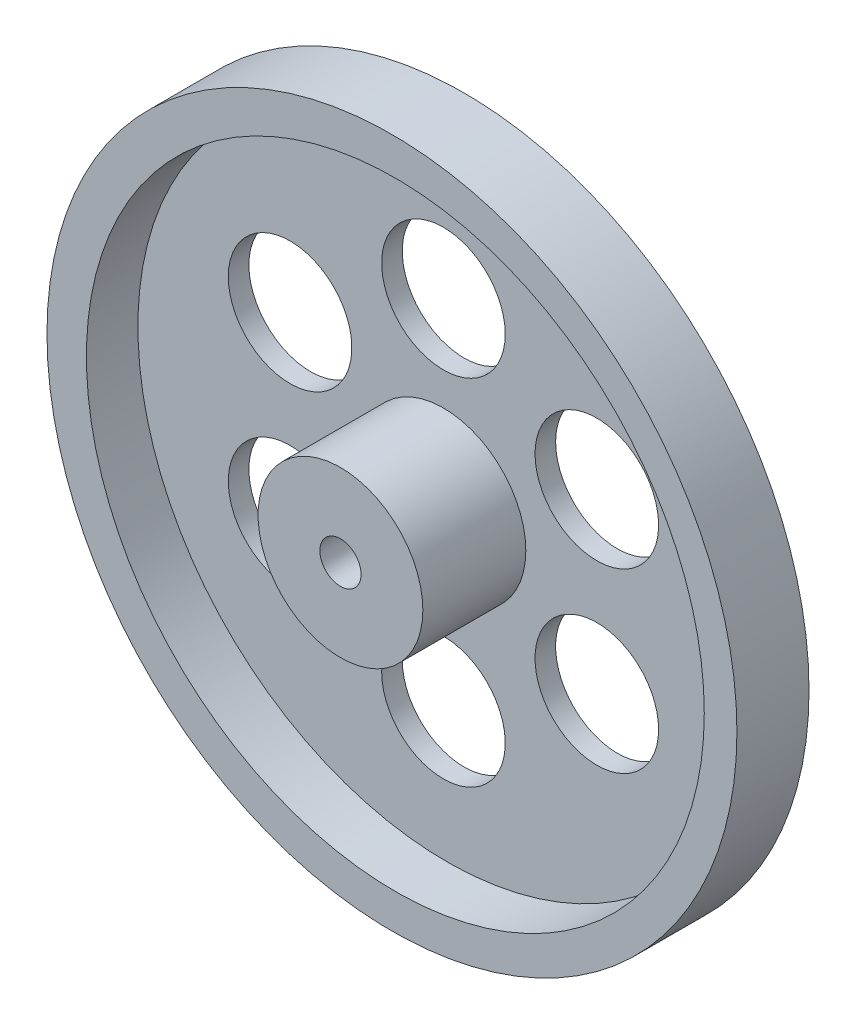
ISO-10303-21;
HEADER;
FILE_DESCRIPTION(('STEP AP214'),'2;1');
FILE_NAME('part.step','',(''),(''),'','','');
FILE_SCHEMA(('AUTOMOTIVE_DESIGN { 1 0 10303 214 1 1 1 1 }'));
ENDSEC;
DATA;
#1=APPLICATION_CONTEXT('core data for automotive mechanical design processes');
#2=APPLICATION_PROTOCOL_DEFINITION('international standard','automotive_design',2000,#1);
#3=PRODUCT_CONTEXT('',#1,'mechanical');
#4=PRODUCT('Part','Part','',(#3));
#5=PRODUCT_RELATED_PRODUCT_CATEGORY('part','',(#4));
#6=PRODUCT_DEFINITION_FORMATION('','',#4);
#7=PRODUCT_DEFINITION_CONTEXT('part definition',#1,'design');
#8=PRODUCT_DEFINITION('design','',#6,#7);
#9=PRODUCT_DEFINITION_SHAPE('','',#8);
#10=(LENGTH_UNIT() NAMED_UNIT(*) SI_UNIT(.MILLI.,.METRE.));
#11=(NAMED_UNIT(*) PLANE_ANGLE_UNIT() SI_UNIT($,.RADIAN.));
#12=(NAMED_UNIT(*) SI_UNIT($,.STERADIAN.) SOLID_ANGLE_UNIT());
#13=UNCERTAINTY_MEASURE_WITH_UNIT(LENGTH_MEASURE(1.E-05),#10,'distance_accuracy_value','');
#14=(GEOMETRIC_REPRESENTATION_CONTEXT(3) GLOBAL_UNCERTAINTY_ASSIGNED_CONTEXT((#13)) GLOBAL_UNIT_ASSIGNED_CONTEXT((#10,
#11,#12)) REPRESENTATION_CONTEXT('',''));
#15=CARTESIAN_POINT('',(0.,0.,0.));
#16=DIRECTION('',(0.,0.,1.));
#17=DIRECTION('',(1.,0.,0.));
#18=AXIS2_PLACEMENT_3D('',#15,#16,#17);
#19=CARTESIAN_POINT('',(0.,0.,7.));
#20=DIRECTION('',(0.,0.,-1.));
#21=DIRECTION('',(-1.,0.,0.));
#22=AXIS2_PLACEMENT_3D('',#19,#20,#21);
#23=CYLINDRICAL_SURFACE('',#22,33.5);
#24=CARTESIAN_POINT('',(0.,0.,7.));
#25=DIRECTION('',(0.,0.,1.));
#26=DIRECTION('',(1.,0.,0.));
#27=AXIS2_PLACEMENT_3D('',#24,#25,#26);
#28=CIRCLE('',#27,33.5);
#29=CARTESIAN_POINT('',(33.5,0.,7.));
#30=VERTEX_POINT('',#29);
#31=EDGE_CURVE('E10',#30,#30,#28,.T.);
#32=ORIENTED_EDGE('',*,*,#31,.F.);
#33=EDGE_LOOP('',(#32));
#34=FACE_BOUND('',#33,.T.);
#35=CARTESIAN_POINT('',(0.,0.,0.));
#36=DIRECTION('',(0.,0.,1.));
#37=DIRECTION('',(1.,0.,0.));
#38=AXIS2_PLACEMENT_3D('',#35,#36,#37);
#39=CIRCLE('',#38,33.5);
#40=CARTESIAN_POINT('',(33.5,0.,0.));
#41=VERTEX_POINT('',#40);
#42=EDGE_CURVE('E38',#41,#41,#39,.T.);
#43=ORIENTED_EDGE('',*,*,#42,.T.);
#44=EDGE_LOOP('',(#43));
#45=FACE_BOUND('',#44,.T.);
#46=ADVANCED_FACE('F35',(#34,#45),#23,.T.);
#47=CARTESIAN_POINT('',(0.,0.,7.));
#48=DIRECTION('',(0.,0.,1.));
#49=DIRECTION('',(1.,0.,0.));
#50=AXIS2_PLACEMENT_3D('',#47,#48,#49);
#51=PLANE('',#50);
#52=CARTESIAN_POINT('',(0.329125808049266,0.,7.));
#53=DIRECTION('',(0.,0.,1.));
#54=DIRECTION('',(1.,0.,0.));
#55=AXIS2_PLACEMENT_3D('',#52,#53,#54);
#56=CIRCLE('',#55,30.);
#57=CARTESIAN_POINT('',(30.3291258080493,0.,7.));
#58=VERTEX_POINT('',#57);
#59=EDGE_CURVE('E47',#58,#58,#56,.T.);
#60=ORIENTED_EDGE('',*,*,#59,.F.);
#61=EDGE_LOOP('',(#60));
#62=FACE_BOUND('',#61,.T.);
#63=ORIENTED_EDGE('',*,*,#31,.T.);
#64=EDGE_LOOP('',(#63));
#65=FACE_BOUND('',#64,.T.);
#66=ADVANCED_FACE('F132',(#62,#65),#51,.T.);
#67=CARTESIAN_POINT('',(0.,0.,0.));
#68=DIRECTION('',(0.,0.,1.));
#69=DIRECTION('',(1.,0.,0.));
#70=AXIS2_PLACEMENT_3D('',#67,#68,#69);
#71=PLANE('',#70);
#72=CARTESIAN_POINT('',(14.8928859899135,8.59841173528723,0.));
#73=DIRECTION('',(0.,0.,1.));
#74=DIRECTION('',(0.50000000000001,-0.866025403784433,0.));
#75=AXIS2_PLACEMENT_3D('',#72,#73,#74);
#76=CIRCLE('',#75,6.);
#77=CARTESIAN_POINT('',(17.8928859899136,3.40225931258063,0.));
#78=VERTEX_POINT('',#77);
#79=EDGE_CURVE('E80',#78,#78,#76,.T.);
#80=ORIENTED_EDGE('',*,*,#79,.T.);
#81=EDGE_LOOP('',(#80));
#82=FACE_BOUND('',#81,.T.);
#83=CARTESIAN_POINT('',(14.8928859899137,-8.59841173528691,0.));
#84=DIRECTION('',(0.,0.,1.));
#85=DIRECTION('',(-0.499999999999992,-0.866025403784443,0.));
#86=AXIS2_PLACEMENT_3D('',#83,#84,#85);
#87=CIRCLE('',#86,6.);
#88=CARTESIAN_POINT('',(11.8928859899138,-13.7945641579936,0.));
#89=VERTEX_POINT('',#88);
#90=EDGE_CURVE('E86',#89,#89,#87,.T.);
#91=ORIENTED_EDGE('',*,*,#90,.T.);
#92=EDGE_LOOP('',(#91));
#93=FACE_BOUND('',#92,.T.);
#94=CARTESIAN_POINT('',(0.,-17.1968234705741,0.));
#95=DIRECTION('',(0.,0.,1.));
#96=DIRECTION('',(-1.,0.,0.));
#97=AXIS2_PLACEMENT_3D('',#94,#95,#96);
#98=CIRCLE('',#97,6.);
#99=CARTESIAN_POINT('',(-6.,-17.1968234705741,0.));
#100=VERTEX_POINT('',#99);
#101=EDGE_CURVE('E92',#100,#100,#98,.T.);
#102=ORIENTED_EDGE('',*,*,#101,.T.);
#103=EDGE_LOOP('',(#102));
#104=FACE_BOUND('',#103,.T.);
#105=CARTESIAN_POINT('',(-14.8928859899136,-8.59841173528712,0.));
#106=DIRECTION('',(0.,0.,1.));
#107=DIRECTION('',(-0.500000000000004,0.866025403784436,0.));
#108=AXIS2_PLACEMENT_3D('',#105,#106,#107);
#109=CIRCLE('',#108,6.);
#110=CARTESIAN_POINT('',(-17.8928859899136,-3.4022593125805,0.));
#111=VERTEX_POINT('',#110);
#112=EDGE_CURVE('E74',#111,#111,#109,.T.);
#113=ORIENTED_EDGE('',*,*,#112,.T.);
#114=EDGE_LOOP('',(#113));
#115=FACE_BOUND('',#114,.T.);
#116=CARTESIAN_POINT('',(-14.8928859899137,8.59841173528702,0.));
#117=DIRECTION('',(0.,0.,1.));
#118=DIRECTION('',(0.499999999999998,0.86602540378444,0.));
#119=AXIS2_PLACEMENT_3D('',#116,#117,#118);
#120=CIRCLE('',#119,6.);
#121=CARTESIAN_POINT('',(-11.8928859899137,13.7945641579937,0.));
#122=VERTEX_POINT('',#121);
#123=EDGE_CURVE('E68',#122,#122,#120,.T.);
#124=ORIENTED_EDGE('',*,*,#123,.T.);
#125=EDGE_LOOP('',(#124));
#126=FACE_BOUND('',#125,.T.);
#127=CARTESIAN_POINT('',(0.,17.1968234705741,0.));
#128=DIRECTION('',(0.,0.,1.));
#129=DIRECTION('',(1.,0.,0.));
#130=AXIS2_PLACEMENT_3D('',#127,#128,#129);
#131=CIRCLE('',#130,6.);
#132=CARTESIAN_POINT('',(6.,17.1968234705741,0.));
#133=VERTEX_POINT('',#132);
#134=EDGE_CURVE('E64',#133,#133,#131,.T.);
#135=ORIENTED_EDGE('',*,*,#134,.T.);
#136=EDGE_LOOP('',(#135));
#137=FACE_BOUND('',#136,.T.);
#138=CARTESIAN_POINT('',(0.,0.,0.));
#139=DIRECTION('',(0.,0.,1.));
#140=DIRECTION('',(1.,0.,0.));
#141=AXIS2_PLACEMENT_3D('',#138,#139,#140);
#142=CIRCLE('',#141,2.);
#143=CARTESIAN_POINT('',(2.,0.,0.));
#144=VERTEX_POINT('',#143);
#145=EDGE_CURVE('E56',#144,#144,#142,.T.);
#146=ORIENTED_EDGE('',*,*,#145,.T.);
#147=EDGE_LOOP('',(#146));
#148=FACE_BOUND('',#147,.T.);
#149=ORIENTED_EDGE('',*,*,#42,.F.);
#150=EDGE_LOOP('',(#149));
#151=FACE_BOUND('',#150,.T.);
#152=ADVANCED_FACE('F101',(#82,#93,#104,#115,#126,#137,#148,#151),#71,.F.);
#153=CARTESIAN_POINT('',(0.329125808049266,0.,2.));
#154=DIRECTION('',(0.,0.,1.));
#155=DIRECTION('',(1.,0.,0.));
#156=AXIS2_PLACEMENT_3D('',#153,#154,#155);
#157=CYLINDRICAL_SURFACE('',#156,30.);
#158=CARTESIAN_POINT('',(0.329125808049266,0.,2.));
#159=DIRECTION('',(0.,0.,1.));
#160=DIRECTION('',(1.,0.,0.));
#161=AXIS2_PLACEMENT_3D('',#158,#159,#160);
#162=CIRCLE('',#161,30.);
#163=CARTESIAN_POINT('',(30.3291258080493,0.,2.));
#164=VERTEX_POINT('',#163);
#165=EDGE_CURVE('E45',#164,#164,#162,.T.);
#166=ORIENTED_EDGE('',*,*,#165,.F.);
#167=EDGE_LOOP('',(#166));
#168=FACE_BOUND('',#167,.T.);
#169=ORIENTED_EDGE('',*,*,#59,.T.);
#170=EDGE_LOOP('',(#169));
#171=FACE_BOUND('',#170,.T.);
#172=ADVANCED_FACE('F116',(#168,#171),#157,.F.);
#173=CARTESIAN_POINT('',(0.329125808049266,0.,2.));
#174=DIRECTION('',(0.,0.,1.));
#175=DIRECTION('',(1.,0.,0.));
#176=AXIS2_PLACEMENT_3D('',#173,#174,#175);
#177=PLANE('',#176);
#178=CARTESIAN_POINT('',(14.8928859899135,8.59841173528723,2.));
#179=DIRECTION('',(0.,0.,1.));
#180=DIRECTION('',(0.50000000000001,-0.866025403784433,0.));
#181=AXIS2_PLACEMENT_3D('',#178,#179,#180);
#182=CIRCLE('',#181,6.);
#183=CARTESIAN_POINT('',(17.8928859899136,3.40225931258063,2.));
#184=VERTEX_POINT('',#183);
#185=EDGE_CURVE('E77',#184,#184,#182,.T.);
#186=ORIENTED_EDGE('',*,*,#185,.F.);
#187=EDGE_LOOP('',(#186));
#188=FACE_BOUND('',#187,.T.);
#189=CARTESIAN_POINT('',(14.8928859899137,-8.59841173528691,2.));
#190=DIRECTION('',(0.,0.,1.));
#191=DIRECTION('',(-0.499999999999992,-0.866025403784443,0.));
#192=AXIS2_PLACEMENT_3D('',#189,#190,#191);
#193=CIRCLE('',#192,6.);
#194=CARTESIAN_POINT('',(11.8928859899138,-13.7945641579936,2.));
#195=VERTEX_POINT('',#194);
#196=EDGE_CURVE('E83',#195,#195,#193,.T.);
#197=ORIENTED_EDGE('',*,*,#196,.F.);
#198=EDGE_LOOP('',(#197));
#199=FACE_BOUND('',#198,.T.);
#200=CARTESIAN_POINT('',(0.,-17.1968234705741,2.));
#201=DIRECTION('',(0.,0.,1.));
#202=DIRECTION('',(-1.,0.,0.));
#203=AXIS2_PLACEMENT_3D('',#200,#201,#202);
#204=CIRCLE('',#203,6.);
#205=CARTESIAN_POINT('',(-6.,-17.1968234705741,2.));
#206=VERTEX_POINT('',#205);
#207=EDGE_CURVE('E89',#206,#206,#204,.T.);
#208=ORIENTED_EDGE('',*,*,#207,.F.);
#209=EDGE_LOOP('',(#208));
#210=FACE_BOUND('',#209,.T.);
#211=CARTESIAN_POINT('',(-14.8928859899136,-8.59841173528712,2.));
#212=DIRECTION('',(0.,0.,1.));
#213=DIRECTION('',(-0.500000000000004,0.866025403784436,0.));
#214=AXIS2_PLACEMENT_3D('',#211,#212,#213);
#215=CIRCLE('',#214,6.);
#216=CARTESIAN_POINT('',(-17.8928859899136,-3.4022593125805,2.));
#217=VERTEX_POINT('',#216);
#218=EDGE_CURVE('E95',#217,#217,#215,.T.);
#219=ORIENTED_EDGE('',*,*,#218,.F.);
#220=EDGE_LOOP('',(#219));
#221=FACE_BOUND('',#220,.T.);
#222=CARTESIAN_POINT('',(-14.8928859899137,8.59841173528702,2.));
#223=DIRECTION('',(0.,0.,1.));
#224=DIRECTION('',(0.499999999999998,0.86602540378444,0.));
#225=AXIS2_PLACEMENT_3D('',#222,#223,#224);
#226=CIRCLE('',#225,6.);
#227=CARTESIAN_POINT('',(-11.8928859899137,13.7945641579937,2.));
#228=VERTEX_POINT('',#227);
#229=EDGE_CURVE('E71',#228,#228,#226,.T.);
#230=ORIENTED_EDGE('',*,*,#229,.F.);
#231=EDGE_LOOP('',(#230));
#232=FACE_BOUND('',#231,.T.);
#233=CARTESIAN_POINT('',(0.,17.1968234705741,2.));
#234=DIRECTION('',(0.,0.,1.));
#235=DIRECTION('',(1.,0.,0.));
#236=AXIS2_PLACEMENT_3D('',#233,#234,#235);
#237=CIRCLE('',#236,6.);
#238=CARTESIAN_POINT('',(6.,17.1968234705741,2.));
#239=VERTEX_POINT('',#238);
#240=EDGE_CURVE('E65',#239,#239,#237,.T.);
#241=ORIENTED_EDGE('',*,*,#240,.F.);
#242=EDGE_LOOP('',(#241));
#243=FACE_BOUND('',#242,.T.);
#244=CARTESIAN_POINT('',(0.,0.,2.));
#245=DIRECTION('',(0.,0.,1.));
#246=DIRECTION('',(1.,0.,0.));
#247=AXIS2_PLACEMENT_3D('',#244,#245,#246);
#248=CIRCLE('',#247,8.);
#249=CARTESIAN_POINT('',(8.,0.,2.));
#250=VERTEX_POINT('',#249);
#251=EDGE_CURVE('E53',#250,#250,#248,.T.);
#252=ORIENTED_EDGE('',*,*,#251,.F.);
#253=EDGE_LOOP('',(#252));
#254=FACE_BOUND('',#253,.T.);
#255=ORIENTED_EDGE('',*,*,#165,.T.);
#256=EDGE_LOOP('',(#255));
#257=FACE_BOUND('',#256,.T.);
#258=ADVANCED_FACE('F112',(#188,#199,#210,#221,#232,#243,#254,#257),#177,.T.);
#259=CARTESIAN_POINT('',(0.,0.,12.));
#260=DIRECTION('',(0.,0.,-1.));
#261=DIRECTION('',(-1.,0.,0.));
#262=AXIS2_PLACEMENT_3D('',#259,#260,#261);
#263=CYLINDRICAL_SURFACE('',#262,8.);
#264=CARTESIAN_POINT('',(0.,0.,12.));
#265=DIRECTION('',(0.,0.,1.));
#266=DIRECTION('',(1.,0.,0.));
#267=AXIS2_PLACEMENT_3D('',#264,#265,#266);
#268=CIRCLE('',#267,8.);
#269=CARTESIAN_POINT('',(8.,0.,12.));
#270=VERTEX_POINT('',#269);
#271=EDGE_CURVE('E50',#270,#270,#268,.T.);
#272=ORIENTED_EDGE('',*,*,#271,.F.);
#273=EDGE_LOOP('',(#272));
#274=FACE_BOUND('',#273,.T.);
#275=ORIENTED_EDGE('',*,*,#251,.T.);
#276=EDGE_LOOP('',(#275));
#277=FACE_BOUND('',#276,.T.);
#278=ADVANCED_FACE('F115',(#274,#277),#263,.T.);
#279=CARTESIAN_POINT('',(0.,0.,12.));
#280=DIRECTION('',(0.,0.,1.));
#281=DIRECTION('',(1.,0.,0.));
#282=AXIS2_PLACEMENT_3D('',#279,#280,#281);
#283=PLANE('',#282);
#284=CARTESIAN_POINT('',(0.,0.,12.));
#285=DIRECTION('',(0.,0.,1.));
#286=DIRECTION('',(1.,0.,0.));
#287=AXIS2_PLACEMENT_3D('',#284,#285,#286);
#288=CIRCLE('',#287,2.);
#289=CARTESIAN_POINT('',(2.,0.,12.));
#290=VERTEX_POINT('',#289);
#291=EDGE_CURVE('E61',#290,#290,#288,.T.);
#292=ORIENTED_EDGE('',*,*,#291,.F.);
#293=EDGE_LOOP('',(#292));
#294=FACE_BOUND('',#293,.T.);
#295=ORIENTED_EDGE('',*,*,#271,.T.);
#296=EDGE_LOOP('',(#295));
#297=FACE_BOUND('',#296,.T.);
#298=ADVANCED_FACE('F144',(#294,#297),#283,.T.);
#299=CARTESIAN_POINT('',(0.,0.,-18.));
#300=DIRECTION('',(0.,0.,1.));
#301=DIRECTION('',(1.,0.,0.));
#302=AXIS2_PLACEMENT_3D('',#299,#300,#301);
#303=CYLINDRICAL_SURFACE('',#302,2.);
#304=ORIENTED_EDGE('',*,*,#291,.T.);
#305=EDGE_LOOP('',(#304));
#306=FACE_BOUND('',#305,.T.);
#307=ORIENTED_EDGE('',*,*,#145,.F.);
#308=EDGE_LOOP('',(#307));
#309=FACE_BOUND('',#308,.T.);
#310=ADVANCED_FACE('F148',(#306,#309),#303,.F.);
#311=CARTESIAN_POINT('',(0.,17.1968234705741,0.));
#312=DIRECTION('',(0.,0.,1.));
#313=DIRECTION('',(1.,0.,0.));
#314=AXIS2_PLACEMENT_3D('',#311,#312,#313);
#315=CYLINDRICAL_SURFACE('',#314,6.);
#316=ORIENTED_EDGE('',*,*,#134,.F.);
#317=EDGE_LOOP('',(#316));
#318=FACE_BOUND('',#317,.T.);
#319=ORIENTED_EDGE('',*,*,#240,.T.);
#320=EDGE_LOOP('',(#319));
#321=FACE_BOUND('',#320,.T.);
#322=ADVANCED_FACE('F152',(#318,#321),#315,.F.);
#323=CARTESIAN_POINT('',(-14.8928859899137,8.59841173528702,0.));
#324=DIRECTION('',(0.,0.,1.));
#325=DIRECTION('',(1.,0.,0.));
#326=AXIS2_PLACEMENT_3D('',#323,#324,#325);
#327=CYLINDRICAL_SURFACE('',#326,6.);
#328=ORIENTED_EDGE('',*,*,#123,.F.);
#329=EDGE_LOOP('',(#328));
#330=FACE_BOUND('',#329,.T.);
#331=ORIENTED_EDGE('',*,*,#229,.T.);
#332=EDGE_LOOP('',(#331));
#333=FACE_BOUND('',#332,.T.);
#334=ADVANCED_FACE('F108',(#330,#333),#327,.F.);
#335=CARTESIAN_POINT('',(-14.8928859899136,-8.59841173528712,0.));
#336=DIRECTION('',(0.,0.,1.));
#337=DIRECTION('',(1.,0.,0.));
#338=AXIS2_PLACEMENT_3D('',#335,#336,#337);
#339=CYLINDRICAL_SURFACE('',#338,6.);
#340=ORIENTED_EDGE('',*,*,#112,.F.);
#341=EDGE_LOOP('',(#340));
#342=FACE_BOUND('',#341,.T.);
#343=ORIENTED_EDGE('',*,*,#218,.T.);
#344=EDGE_LOOP('',(#343));
#345=FACE_BOUND('',#344,.T.);
#346=ADVANCED_FACE('F104',(#342,#345),#339,.F.);
#347=CARTESIAN_POINT('',(0.,-17.1968234705741,0.));
#348=DIRECTION('',(0.,0.,1.));
#349=DIRECTION('',(1.,0.,0.));
#350=AXIS2_PLACEMENT_3D('',#347,#348,#349);
#351=CYLINDRICAL_SURFACE('',#350,6.);
#352=ORIENTED_EDGE('',*,*,#101,.F.);
#353=EDGE_LOOP('',(#352));
#354=FACE_BOUND('',#353,.T.);
#355=ORIENTED_EDGE('',*,*,#207,.T.);
#356=EDGE_LOOP('',(#355));
#357=FACE_BOUND('',#356,.T.);
#358=ADVANCED_FACE('F107',(#354,#357),#351,.F.);
#359=CARTESIAN_POINT('',(14.8928859899137,-8.59841173528691,0.));
#360=DIRECTION('',(0.,0.,1.));
#361=DIRECTION('',(1.,0.,0.));
#362=AXIS2_PLACEMENT_3D('',#359,#360,#361);
#363=CYLINDRICAL_SURFACE('',#362,6.);
#364=ORIENTED_EDGE('',*,*,#90,.F.);
#365=EDGE_LOOP('',(#364));
#366=FACE_BOUND('',#365,.T.);
#367=ORIENTED_EDGE('',*,*,#196,.T.);
#368=EDGE_LOOP('',(#367));
#369=FACE_BOUND('',#368,.T.);
#370=ADVANCED_FACE('F163',(#366,#369),#363,.F.);
#371=CARTESIAN_POINT('',(14.8928859899135,8.59841173528723,0.));
#372=DIRECTION('',(0.,0.,1.));
#373=DIRECTION('',(1.,0.,0.));
#374=AXIS2_PLACEMENT_3D('',#371,#372,#373);
#375=CYLINDRICAL_SURFACE('',#374,6.);
#376=ORIENTED_EDGE('',*,*,#79,.F.);
#377=EDGE_LOOP('',(#376));
#378=FACE_BOUND('',#377,.T.);
#379=ORIENTED_EDGE('',*,*,#185,.T.);
#380=EDGE_LOOP('',(#379));
#381=FACE_BOUND('',#380,.T.);
#382=ADVANCED_FACE('F160',(#378,#381),#375,.F.);
#383=CLOSED_SHELL('',(#46,#66,#152,#172,#258,#278,#298,#310,#322,#334,#346,#358,#370,#382));
#384=MANIFOLD_SOLID_BREP('B2',#383);
#385=ADVANCED_BREP_SHAPE_REPRESENTATION('',(#18,#384),#14);
#386=SHAPE_DEFINITION_REPRESENTATION(#9,#385);
ENDSEC;
END-ISO-10303-21;
